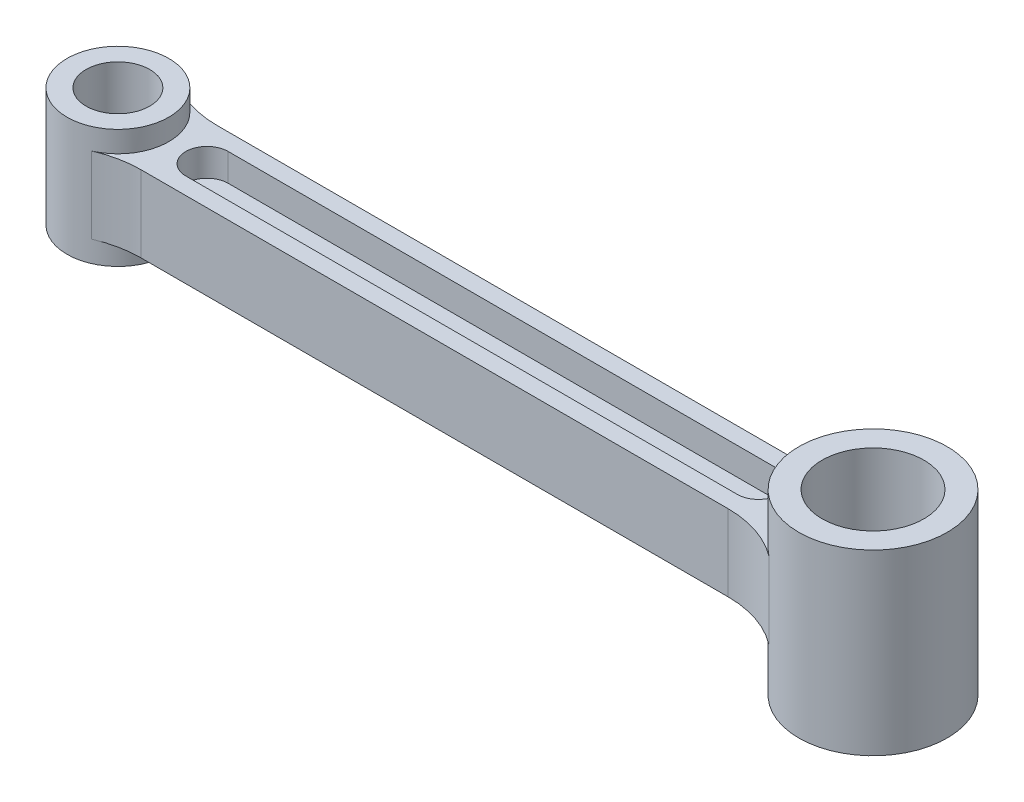
ISO-10303-21;
HEADER;
FILE_DESCRIPTION(('STEP AP214'),'2;1');
FILE_NAME('part.step','',(''),(''),'','','');
FILE_SCHEMA(('AUTOMOTIVE_DESIGN { 1 0 10303 214 1 1 1 1 }'));
ENDSEC;
DATA;
#1=APPLICATION_CONTEXT('core data for automotive mechanical design processes');
#2=APPLICATION_PROTOCOL_DEFINITION('international standard','automotive_design',2000,#1);
#3=PRODUCT_CONTEXT('',#1,'mechanical');
#4=PRODUCT('Part','Part','',(#3));
#5=PRODUCT_RELATED_PRODUCT_CATEGORY('part','',(#4));
#6=PRODUCT_DEFINITION_FORMATION('','',#4);
#7=PRODUCT_DEFINITION_CONTEXT('part definition',#1,'design');
#8=PRODUCT_DEFINITION('design','',#6,#7);
#9=PRODUCT_DEFINITION_SHAPE('','',#8);
#10=(LENGTH_UNIT() NAMED_UNIT(*) SI_UNIT(.MILLI.,.METRE.));
#11=(NAMED_UNIT(*) PLANE_ANGLE_UNIT() SI_UNIT($,.RADIAN.));
#12=(NAMED_UNIT(*) SI_UNIT($,.STERADIAN.) SOLID_ANGLE_UNIT());
#13=UNCERTAINTY_MEASURE_WITH_UNIT(LENGTH_MEASURE(1.E-05),#10,'distance_accuracy_value','');
#14=(GEOMETRIC_REPRESENTATION_CONTEXT(3) GLOBAL_UNCERTAINTY_ASSIGNED_CONTEXT((#13)) GLOBAL_UNIT_ASSIGNED_CONTEXT((#10,
#11,#12)) REPRESENTATION_CONTEXT('',''));
#15=CARTESIAN_POINT('',(0.,0.,0.));
#16=DIRECTION('',(0.,0.,1.));
#17=DIRECTION('',(1.,0.,0.));
#18=AXIS2_PLACEMENT_3D('',#15,#16,#17);
#19=CARTESIAN_POINT('',(0.,-9.,0.));
#20=DIRECTION('',(0.,1.,0.));
#21=DIRECTION('',(0.,0.,1.));
#22=AXIS2_PLACEMENT_3D('',#19,#20,#21);
#23=PLANE('',#22);
#24=CARTESIAN_POINT('',(0.,-9.,0.));
#25=DIRECTION('',(0.,-1.,0.));
#26=DIRECTION('',(0.,0.,1.));
#27=AXIS2_PLACEMENT_3D('',#24,#25,#26);
#28=CIRCLE('',#27,12.);
#29=CARTESIAN_POINT('',(4.79583152331272,-9.,-11.));
#30=VERTEX_POINT('',#29);
#31=CARTESIAN_POINT('',(4.79583152331272,-9.,11.));
#32=VERTEX_POINT('',#31);
#33=EDGE_CURVE('E265',#30,#32,#28,.T.);
#34=ORIENTED_EDGE('',*,*,#33,.F.);
#35=CARTESIAN_POINT('',(14.3874945699382,-9.,-33.));
#36=DIRECTION('',(0.,1.,0.));
#37=DIRECTION('',(0.,0.,1.));
#38=AXIS2_PLACEMENT_3D('',#35,#36,#37);
#39=CIRCLE('',#38,24.);
#40=CARTESIAN_POINT('',(14.3874945699382,-9.,-9.));
#41=VERTEX_POINT('',#40);
#42=EDGE_CURVE('E339',#30,#41,#39,.T.);
#43=ORIENTED_EDGE('',*,*,#42,.T.);
#44=DIRECTION('',(-1.,0.,0.));
#45=VECTOR('',#44,1.);
#46=CARTESIAN_POINT('',(7.93725393319378,-9.,-9.));
#47=LINE('',#46,#45);
#48=CARTESIAN_POINT('',(152.835540935677,-9.,-9.));
#49=VERTEX_POINT('',#48);
#50=EDGE_CURVE('E273',#49,#41,#47,.T.);
#51=ORIENTED_EDGE('',*,*,#50,.F.);
#52=CARTESIAN_POINT('',(152.835540935677,-9.,-33.));
#53=DIRECTION('',(0.,1.,0.));
#54=DIRECTION('',(0.,0.,1.));
#55=AXIS2_PLACEMENT_3D('',#52,#53,#54);
#56=CIRCLE('',#55,24.);
#57=CARTESIAN_POINT('',(167.388481117454,-9.,-13.9156626506024));
#58=VERTEX_POINT('',#57);
#59=EDGE_CURVE('E346',#49,#58,#56,.T.);
#60=ORIENTED_EDGE('',*,*,#59,.T.);
#61=CARTESIAN_POINT('',(178.,-9.,0.));
#62=DIRECTION('',(0.,-1.,0.));
#63=DIRECTION('',(0.,0.,1.));
#64=AXIS2_PLACEMENT_3D('',#61,#62,#63);
#65=CIRCLE('',#64,17.5);
#66=CARTESIAN_POINT('',(167.388481117454,-9.,13.9156626506024));
#67=VERTEX_POINT('',#66);
#68=EDGE_CURVE('E289',#67,#58,#65,.T.);
#69=ORIENTED_EDGE('',*,*,#68,.F.);
#70=CARTESIAN_POINT('',(152.835540935677,-9.,33.));
#71=DIRECTION('',(0.,1.,0.));
#72=DIRECTION('',(0.,0.,1.));
#73=AXIS2_PLACEMENT_3D('',#70,#71,#72);
#74=CIRCLE('',#73,24.);
#75=CARTESIAN_POINT('',(152.835540935677,-9.,9.));
#76=VERTEX_POINT('',#75);
#77=EDGE_CURVE('E353',#67,#76,#74,.T.);
#78=ORIENTED_EDGE('',*,*,#77,.T.);
#79=DIRECTION('',(1.,0.,0.));
#80=VECTOR('',#79,1.);
#81=CARTESIAN_POINT('',(7.93725393319378,-9.,9.));
#82=LINE('',#81,#80);
#83=CARTESIAN_POINT('',(14.3874945699382,-9.,9.));
#84=VERTEX_POINT('',#83);
#85=EDGE_CURVE('E286',#84,#76,#82,.T.);
#86=ORIENTED_EDGE('',*,*,#85,.F.);
#87=CARTESIAN_POINT('',(14.3874945699382,-9.,33.));
#88=DIRECTION('',(0.,1.,0.));
#89=DIRECTION('',(0.,0.,1.));
#90=AXIS2_PLACEMENT_3D('',#87,#88,#89);
#91=CIRCLE('',#90,24.);
#92=EDGE_CURVE('E49',#84,#32,#91,.T.);
#93=ORIENTED_EDGE('',*,*,#92,.T.);
#94=EDGE_LOOP('',(#34,#43,#51,#60,#69,#78,#86,#93));
#95=FACE_BOUND('',#94,.T.);
#96=CARTESIAN_POINT('',(21.,-9.,0.));
#97=DIRECTION('',(0.,1.,0.));
#98=DIRECTION('',(0.,0.,1.));
#99=AXIS2_PLACEMENT_3D('',#96,#97,#98);
#100=CIRCLE('',#99,5.);
#101=CARTESIAN_POINT('',(21.,-9.,-5.));
#102=VERTEX_POINT('',#101);
#103=CARTESIAN_POINT('',(21.,-9.,5.));
#104=VERTEX_POINT('',#103);
#105=EDGE_CURVE('E174',#102,#104,#100,.T.);
#106=ORIENTED_EDGE('',*,*,#105,.T.);
#107=DIRECTION('',(1.,0.,0.));
#108=VECTOR('',#107,1.);
#109=CARTESIAN_POINT('',(21.,-9.,5.));
#110=LINE('',#109,#108);
#111=CARTESIAN_POINT('',(151.,-9.,5.));
#112=VERTEX_POINT('',#111);
#113=EDGE_CURVE('E180',#104,#112,#110,.T.);
#114=ORIENTED_EDGE('',*,*,#113,.T.);
#115=CARTESIAN_POINT('',(151.,-9.,0.));
#116=DIRECTION('',(0.,1.,0.));
#117=DIRECTION('',(0.,0.,-1.));
#118=AXIS2_PLACEMENT_3D('',#115,#116,#117);
#119=CIRCLE('',#118,5.);
#120=CARTESIAN_POINT('',(151.,-9.,-5.));
#121=VERTEX_POINT('',#120);
#122=EDGE_CURVE('E185',#112,#121,#119,.T.);
#123=ORIENTED_EDGE('',*,*,#122,.T.);
#124=DIRECTION('',(-1.,0.,0.));
#125=VECTOR('',#124,1.);
#126=CARTESIAN_POINT('',(21.,-9.,-5.));
#127=LINE('',#126,#125);
#128=EDGE_CURVE('E194',#121,#102,#127,.T.);
#129=ORIENTED_EDGE('',*,*,#128,.T.);
#130=EDGE_LOOP('',(#106,#114,#123,#129));
#131=FACE_BOUND('',#130,.T.);
#132=ADVANCED_FACE('F40',(#95,#131),#23,.F.);
#133=CARTESIAN_POINT('',(0.,14.,0.));
#134=DIRECTION('',(0.,1.,0.));
#135=DIRECTION('',(0.,0.,1.));
#136=AXIS2_PLACEMENT_3D('',#133,#134,#135);
#137=PLANE('',#136);
#138=CARTESIAN_POINT('',(0.,14.,0.));
#139=DIRECTION('',(0.,1.,0.));
#140=DIRECTION('',(0.,0.,1.));
#141=AXIS2_PLACEMENT_3D('',#138,#139,#140);
#142=CIRCLE('',#141,12.);
#143=CARTESIAN_POINT('',(0.,14.,12.));
#144=VERTEX_POINT('',#143);
#145=EDGE_CURVE('E303',#144,#144,#142,.T.);
#146=ORIENTED_EDGE('',*,*,#145,.T.);
#147=EDGE_LOOP('',(#146));
#148=FACE_BOUND('',#147,.T.);
#149=CARTESIAN_POINT('',(0.,14.,0.));
#150=DIRECTION('',(0.,1.,0.));
#151=DIRECTION('',(0.,0.,1.));
#152=AXIS2_PLACEMENT_3D('',#149,#150,#151);
#153=CIRCLE('',#152,7.5);
#154=CARTESIAN_POINT('',(0.,14.,7.5));
#155=VERTEX_POINT('',#154);
#156=EDGE_CURVE('E295',#155,#155,#153,.T.);
#157=ORIENTED_EDGE('',*,*,#156,.F.);
#158=EDGE_LOOP('',(#157));
#159=FACE_BOUND('',#158,.T.);
#160=ADVANCED_FACE('F407',(#148,#159),#137,.T.);
#161=CARTESIAN_POINT('',(0.,-14.,0.));
#162=DIRECTION('',(0.,1.,0.));
#163=DIRECTION('',(0.,0.,1.));
#164=AXIS2_PLACEMENT_3D('',#161,#162,#163);
#165=PLANE('',#164);
#166=CARTESIAN_POINT('',(0.,-14.,0.));
#167=DIRECTION('',(0.,1.,0.));
#168=DIRECTION('',(0.,0.,1.));
#169=AXIS2_PLACEMENT_3D('',#166,#167,#168);
#170=CIRCLE('',#169,12.);
#171=CARTESIAN_POINT('',(0.,-14.,12.));
#172=VERTEX_POINT('',#171);
#173=EDGE_CURVE('E299',#172,#172,#170,.T.);
#174=ORIENTED_EDGE('',*,*,#173,.F.);
#175=EDGE_LOOP('',(#174));
#176=FACE_BOUND('',#175,.T.);
#177=CARTESIAN_POINT('',(0.,-14.,0.));
#178=DIRECTION('',(0.,1.,0.));
#179=DIRECTION('',(0.,0.,1.));
#180=AXIS2_PLACEMENT_3D('',#177,#178,#179);
#181=CIRCLE('',#180,7.5);
#182=CARTESIAN_POINT('',(0.,-14.,7.5));
#183=VERTEX_POINT('',#182);
#184=EDGE_CURVE('E283',#183,#183,#181,.T.);
#185=ORIENTED_EDGE('',*,*,#184,.T.);
#186=EDGE_LOOP('',(#185));
#187=FACE_BOUND('',#186,.T.);
#188=ADVANCED_FACE('F412',(#176,#187),#165,.F.);
#189=CARTESIAN_POINT('',(0.,14.,0.));
#190=DIRECTION('',(0.,-1.,0.));
#191=DIRECTION('',(0.,0.,-1.));
#192=AXIS2_PLACEMENT_3D('',#189,#190,#191);
#193=CYLINDRICAL_SURFACE('',#192,12.);
#194=DIRECTION('',(0.,-1.,0.));
#195=VECTOR('',#194,1.);
#196=CARTESIAN_POINT('',(4.79583152331272,14.,-11.));
#197=LINE('',#196,#195);
#198=CARTESIAN_POINT('',(4.79583152331272,9.,-11.));
#199=VERTEX_POINT('',#198);
#200=EDGE_CURVE('E314',#199,#30,#197,.T.);
#201=ORIENTED_EDGE('',*,*,#200,.T.);
#202=ORIENTED_EDGE('',*,*,#33,.T.);
#203=DIRECTION('',(0.,-1.,0.));
#204=VECTOR('',#203,1.);
#205=CARTESIAN_POINT('',(4.79583152331272,14.,11.));
#206=LINE('',#205,#204);
#207=CARTESIAN_POINT('',(4.79583152331272,9.,11.));
#208=VERTEX_POINT('',#207);
#209=EDGE_CURVE('E307',#32,#208,#206,.F.);
#210=ORIENTED_EDGE('',*,*,#209,.T.);
#211=CARTESIAN_POINT('',(0.,9.,0.));
#212=DIRECTION('',(0.,-1.,0.));
#213=DIRECTION('',(0.,0.,1.));
#214=AXIS2_PLACEMENT_3D('',#211,#212,#213);
#215=CIRCLE('',#214,12.);
#216=EDGE_CURVE('E269',#199,#208,#215,.T.);
#217=ORIENTED_EDGE('',*,*,#216,.F.);
#218=EDGE_LOOP('',(#201,#202,#210,#217));
#219=FACE_BOUND('',#218,.T.);
#220=ORIENTED_EDGE('',*,*,#145,.F.);
#221=EDGE_LOOP('',(#220));
#222=FACE_BOUND('',#221,.T.);
#223=ORIENTED_EDGE('',*,*,#173,.T.);
#224=EDGE_LOOP('',(#223));
#225=FACE_BOUND('',#224,.T.);
#226=ADVANCED_FACE('F370',(#219,#222,#225),#193,.T.);
#227=CARTESIAN_POINT('',(0.,14.,0.));
#228=DIRECTION('',(0.,-1.,0.));
#229=DIRECTION('',(0.,0.,-1.));
#230=AXIS2_PLACEMENT_3D('',#227,#228,#229);
#231=CYLINDRICAL_SURFACE('',#230,7.5);
#232=ORIENTED_EDGE('',*,*,#156,.T.);
#233=EDGE_LOOP('',(#232));
#234=FACE_BOUND('',#233,.T.);
#235=ORIENTED_EDGE('',*,*,#184,.F.);
#236=EDGE_LOOP('',(#235));
#237=FACE_BOUND('',#236,.T.);
#238=ADVANCED_FACE('F397',(#234,#237),#231,.F.);
#239=CARTESIAN_POINT('',(7.93725393319378,9.,9.));
#240=DIRECTION('',(0.,0.,-1.));
#241=DIRECTION('',(-1.,0.,0.));
#242=AXIS2_PLACEMENT_3D('',#239,#240,#241);
#243=PLANE('',#242);
#244=ORIENTED_EDGE('',*,*,#85,.T.);
#245=DIRECTION('',(0.,1.,0.));
#246=VECTOR('',#245,1.);
#247=CARTESIAN_POINT('',(152.835540935677,9.,9.));
#248=LINE('',#247,#246);
#249=CARTESIAN_POINT('',(152.835540935677,9.,9.));
#250=VERTEX_POINT('',#249);
#251=EDGE_CURVE('E56',#76,#250,#248,.T.);
#252=ORIENTED_EDGE('',*,*,#251,.T.);
#253=DIRECTION('',(1.,0.,0.));
#254=VECTOR('',#253,1.);
#255=CARTESIAN_POINT('',(7.93725393319378,9.,9.));
#256=LINE('',#255,#254);
#257=CARTESIAN_POINT('',(14.3874945699382,9.,9.));
#258=VERTEX_POINT('',#257);
#259=EDGE_CURVE('E272',#258,#250,#256,.T.);
#260=ORIENTED_EDGE('',*,*,#259,.F.);
#261=DIRECTION('',(0.,1.,0.));
#262=VECTOR('',#261,1.);
#263=CARTESIAN_POINT('',(14.3874945699382,-9.,9.));
#264=LINE('',#263,#262);
#265=EDGE_CURVE('E333',#258,#84,#264,.F.);
#266=ORIENTED_EDGE('',*,*,#265,.T.);
#267=EDGE_LOOP('',(#244,#252,#260,#266));
#268=FACE_BOUND('',#267,.T.);
#269=ADVANCED_FACE('F395',(#268),#243,.F.);
#270=CARTESIAN_POINT('',(7.93725393319378,9.,-9.));
#271=DIRECTION('',(0.,0.,1.));
#272=DIRECTION('',(1.,0.,0.));
#273=AXIS2_PLACEMENT_3D('',#270,#271,#272);
#274=PLANE('',#273);
#275=ORIENTED_EDGE('',*,*,#50,.T.);
#276=DIRECTION('',(0.,1.,0.));
#277=VECTOR('',#276,1.);
#278=CARTESIAN_POINT('',(14.3874945699382,9.,-9.));
#279=LINE('',#278,#277);
#280=CARTESIAN_POINT('',(14.3874945699382,9.,-9.));
#281=VERTEX_POINT('',#280);
#282=EDGE_CURVE('E322',#41,#281,#279,.T.);
#283=ORIENTED_EDGE('',*,*,#282,.T.);
#284=DIRECTION('',(-1.,0.,0.));
#285=VECTOR('',#284,1.);
#286=CARTESIAN_POINT('',(7.93725393319378,9.,-9.));
#287=LINE('',#286,#285);
#288=CARTESIAN_POINT('',(152.835540935677,9.,-9.));
#289=VERTEX_POINT('',#288);
#290=EDGE_CURVE('E279',#289,#281,#287,.T.);
#291=ORIENTED_EDGE('',*,*,#290,.F.);
#292=DIRECTION('',(0.,1.,0.));
#293=VECTOR('',#292,1.);
#294=CARTESIAN_POINT('',(152.835540935677,-8.99999999999999,-9.));
#295=LINE('',#294,#293);
#296=EDGE_CURVE('E318',#289,#49,#295,.F.);
#297=ORIENTED_EDGE('',*,*,#296,.T.);
#298=EDGE_LOOP('',(#275,#283,#291,#297));
#299=FACE_BOUND('',#298,.T.);
#300=ADVANCED_FACE('F379',(#299),#274,.F.);
#301=CARTESIAN_POINT('',(0.,9.,0.));
#302=DIRECTION('',(0.,1.,0.));
#303=DIRECTION('',(0.,0.,1.));
#304=AXIS2_PLACEMENT_3D('',#301,#302,#303);
#305=PLANE('',#304);
#306=CARTESIAN_POINT('',(21.,9.,0.));
#307=DIRECTION('',(0.,1.,0.));
#308=DIRECTION('',(0.,0.,1.));
#309=AXIS2_PLACEMENT_3D('',#306,#307,#308);
#310=CIRCLE('',#309,5.);
#311=CARTESIAN_POINT('',(21.,9.,-5.));
#312=VERTEX_POINT('',#311);
#313=CARTESIAN_POINT('',(21.,9.,5.));
#314=VERTEX_POINT('',#313);
#315=EDGE_CURVE('E203',#312,#314,#310,.T.);
#316=ORIENTED_EDGE('',*,*,#315,.F.);
#317=DIRECTION('',(-1.,0.,0.));
#318=VECTOR('',#317,1.);
#319=CARTESIAN_POINT('',(21.,9.,-5.));
#320=LINE('',#319,#318);
#321=CARTESIAN_POINT('',(151.,9.,-5.));
#322=VERTEX_POINT('',#321);
#323=EDGE_CURVE('E214',#322,#312,#320,.T.);
#324=ORIENTED_EDGE('',*,*,#323,.F.);
#325=CARTESIAN_POINT('',(151.,9.,0.));
#326=DIRECTION('',(0.,1.,0.));
#327=DIRECTION('',(0.,0.,-1.));
#328=AXIS2_PLACEMENT_3D('',#325,#326,#327);
#329=CIRCLE('',#328,5.);
#330=CARTESIAN_POINT('',(151.,9.,5.));
#331=VERTEX_POINT('',#330);
#332=EDGE_CURVE('E233',#331,#322,#329,.T.);
#333=ORIENTED_EDGE('',*,*,#332,.F.);
#334=DIRECTION('',(1.,0.,0.));
#335=VECTOR('',#334,1.);
#336=CARTESIAN_POINT('',(21.,9.,5.));
#337=LINE('',#336,#335);
#338=EDGE_CURVE('E229',#314,#331,#337,.T.);
#339=ORIENTED_EDGE('',*,*,#338,.F.);
#340=EDGE_LOOP('',(#316,#324,#333,#339));
#341=FACE_BOUND('',#340,.T.);
#342=ORIENTED_EDGE('',*,*,#216,.T.);
#343=CARTESIAN_POINT('',(14.3874945699382,9.,33.));
#344=DIRECTION('',(0.,1.,0.));
#345=DIRECTION('',(0.,0.,1.));
#346=AXIS2_PLACEMENT_3D('',#343,#344,#345);
#347=CIRCLE('',#346,24.);
#348=EDGE_CURVE('E11',#208,#258,#347,.F.);
#349=ORIENTED_EDGE('',*,*,#348,.T.);
#350=ORIENTED_EDGE('',*,*,#259,.T.);
#351=CARTESIAN_POINT('',(152.835540935677,9.,33.));
#352=DIRECTION('',(0.,1.,0.));
#353=DIRECTION('',(0.,0.,1.));
#354=AXIS2_PLACEMENT_3D('',#351,#352,#353);
#355=CIRCLE('',#354,24.);
#356=CARTESIAN_POINT('',(167.388481117454,9.,13.9156626506024));
#357=VERTEX_POINT('',#356);
#358=EDGE_CURVE('E356',#250,#357,#355,.F.);
#359=ORIENTED_EDGE('',*,*,#358,.T.);
#360=CARTESIAN_POINT('',(178.,9.,0.));
#361=DIRECTION('',(0.,-1.,0.));
#362=DIRECTION('',(0.,0.,1.));
#363=AXIS2_PLACEMENT_3D('',#360,#361,#362);
#364=CIRCLE('',#363,17.5);
#365=CARTESIAN_POINT('',(167.388481117454,9.,-13.9156626506024));
#366=VERTEX_POINT('',#365);
#367=EDGE_CURVE('E276',#357,#366,#364,.T.);
#368=ORIENTED_EDGE('',*,*,#367,.T.);
#369=CARTESIAN_POINT('',(152.835540935677,9.,-33.));
#370=DIRECTION('',(0.,1.,0.));
#371=DIRECTION('',(0.,0.,1.));
#372=AXIS2_PLACEMENT_3D('',#369,#370,#371);
#373=CIRCLE('',#372,24.);
#374=EDGE_CURVE('E350',#366,#289,#373,.F.);
#375=ORIENTED_EDGE('',*,*,#374,.T.);
#376=ORIENTED_EDGE('',*,*,#290,.T.);
#377=CARTESIAN_POINT('',(14.3874945699382,9.,-33.));
#378=DIRECTION('',(0.,1.,0.));
#379=DIRECTION('',(0.,0.,1.));
#380=AXIS2_PLACEMENT_3D('',#377,#378,#379);
#381=CIRCLE('',#380,24.);
#382=EDGE_CURVE('E342',#281,#199,#381,.F.);
#383=ORIENTED_EDGE('',*,*,#382,.T.);
#384=EDGE_LOOP('',(#342,#349,#350,#359,#368,#375,#376,#383));
#385=FACE_BOUND('',#384,.T.);
#386=ADVANCED_FACE('F394',(#341,#385),#305,.T.);
#387=CARTESIAN_POINT('',(178.,21.,0.));
#388=DIRECTION('',(0.,1.,0.));
#389=DIRECTION('',(0.,0.,1.));
#390=AXIS2_PLACEMENT_3D('',#387,#388,#389);
#391=PLANE('',#390);
#392=CARTESIAN_POINT('',(178.,21.,0.));
#393=DIRECTION('',(0.,1.,0.));
#394=DIRECTION('',(0.,0.,1.));
#395=AXIS2_PLACEMENT_3D('',#392,#393,#394);
#396=CIRCLE('',#395,17.5);
#397=CARTESIAN_POINT('',(178.,21.,17.5));
#398=VERTEX_POINT('',#397);
#399=EDGE_CURVE('E261',#398,#398,#396,.T.);
#400=ORIENTED_EDGE('',*,*,#399,.T.);
#401=EDGE_LOOP('',(#400));
#402=FACE_BOUND('',#401,.T.);
#403=CARTESIAN_POINT('',(178.,21.,0.));
#404=DIRECTION('',(0.,1.,0.));
#405=DIRECTION('',(0.,0.,1.));
#406=AXIS2_PLACEMENT_3D('',#403,#404,#405);
#407=CIRCLE('',#406,12.);
#408=CARTESIAN_POINT('',(178.,21.,12.));
#409=VERTEX_POINT('',#408);
#410=EDGE_CURVE('E253',#409,#409,#407,.T.);
#411=ORIENTED_EDGE('',*,*,#410,.F.);
#412=EDGE_LOOP('',(#411));
#413=FACE_BOUND('',#412,.T.);
#414=ADVANCED_FACE('F418',(#402,#413),#391,.T.);
#415=CARTESIAN_POINT('',(178.,-21.,0.));
#416=DIRECTION('',(0.,1.,0.));
#417=DIRECTION('',(0.,0.,1.));
#418=AXIS2_PLACEMENT_3D('',#415,#416,#417);
#419=PLANE('',#418);
#420=CARTESIAN_POINT('',(178.,-21.,0.));
#421=DIRECTION('',(0.,1.,0.));
#422=DIRECTION('',(0.,0.,1.));
#423=AXIS2_PLACEMENT_3D('',#420,#421,#422);
#424=CIRCLE('',#423,17.5);
#425=CARTESIAN_POINT('',(178.,-21.,17.5));
#426=VERTEX_POINT('',#425);
#427=EDGE_CURVE('E257',#426,#426,#424,.T.);
#428=ORIENTED_EDGE('',*,*,#427,.F.);
#429=EDGE_LOOP('',(#428));
#430=FACE_BOUND('',#429,.T.);
#431=CARTESIAN_POINT('',(178.,-21.,0.));
#432=DIRECTION('',(0.,1.,0.));
#433=DIRECTION('',(0.,0.,1.));
#434=AXIS2_PLACEMENT_3D('',#431,#432,#433);
#435=CIRCLE('',#434,12.);
#436=CARTESIAN_POINT('',(178.,-21.,12.));
#437=VERTEX_POINT('',#436);
#438=EDGE_CURVE('E243',#437,#437,#435,.T.);
#439=ORIENTED_EDGE('',*,*,#438,.T.);
#440=EDGE_LOOP('',(#439));
#441=FACE_BOUND('',#440,.T.);
#442=ADVANCED_FACE('F423',(#430,#441),#419,.F.);
#443=CARTESIAN_POINT('',(178.,21.,0.));
#444=DIRECTION('',(0.,-1.,0.));
#445=DIRECTION('',(0.,0.,-1.));
#446=AXIS2_PLACEMENT_3D('',#443,#444,#445);
#447=CYLINDRICAL_SURFACE('',#446,17.5);
#448=ORIENTED_EDGE('',*,*,#68,.T.);
#449=DIRECTION('',(0.,-1.,0.));
#450=VECTOR('',#449,1.);
#451=CARTESIAN_POINT('',(167.388481117454,21.,-13.9156626506024));
#452=LINE('',#451,#450);
#453=EDGE_CURVE('E329',#58,#366,#452,.F.);
#454=ORIENTED_EDGE('',*,*,#453,.T.);
#455=ORIENTED_EDGE('',*,*,#367,.F.);
#456=DIRECTION('',(0.,-1.,0.));
#457=VECTOR('',#456,1.);
#458=CARTESIAN_POINT('',(167.388481117454,21.,13.9156626506024));
#459=LINE('',#458,#457);
#460=EDGE_CURVE('E325',#357,#67,#459,.T.);
#461=ORIENTED_EDGE('',*,*,#460,.T.);
#462=EDGE_LOOP('',(#448,#454,#455,#461));
#463=FACE_BOUND('',#462,.T.);
#464=ORIENTED_EDGE('',*,*,#399,.F.);
#465=EDGE_LOOP('',(#464));
#466=FACE_BOUND('',#465,.T.);
#467=ORIENTED_EDGE('',*,*,#427,.T.);
#468=EDGE_LOOP('',(#467));
#469=FACE_BOUND('',#468,.T.);
#470=ADVANCED_FACE('F392',(#463,#466,#469),#447,.T.);
#471=CARTESIAN_POINT('',(178.,21.,0.));
#472=DIRECTION('',(0.,-1.,0.));
#473=DIRECTION('',(0.,0.,-1.));
#474=AXIS2_PLACEMENT_3D('',#471,#472,#473);
#475=CYLINDRICAL_SURFACE('',#474,12.);
#476=ORIENTED_EDGE('',*,*,#410,.T.);
#477=EDGE_LOOP('',(#476));
#478=FACE_BOUND('',#477,.T.);
#479=ORIENTED_EDGE('',*,*,#438,.F.);
#480=EDGE_LOOP('',(#479));
#481=FACE_BOUND('',#480,.T.);
#482=ADVANCED_FACE('F422',(#478,#481),#475,.F.);
#483=CARTESIAN_POINT('',(21.,2.5,0.));
#484=DIRECTION('',(0.,1.,0.));
#485=DIRECTION('',(0.,0.,1.));
#486=AXIS2_PLACEMENT_3D('',#483,#484,#485);
#487=CYLINDRICAL_SURFACE('',#486,5.);
#488=ORIENTED_EDGE('',*,*,#315,.T.);
#489=DIRECTION('',(0.,1.,0.));
#490=VECTOR('',#489,1.);
#491=CARTESIAN_POINT('',(21.,2.5,5.));
#492=LINE('',#491,#490);
#493=CARTESIAN_POINT('',(21.,2.5,5.));
#494=VERTEX_POINT('',#493);
#495=EDGE_CURVE('E226',#494,#314,#492,.T.);
#496=ORIENTED_EDGE('',*,*,#495,.F.);
#497=CARTESIAN_POINT('',(21.,2.5,0.));
#498=DIRECTION('',(0.,1.,0.));
#499=DIRECTION('',(0.,0.,1.));
#500=AXIS2_PLACEMENT_3D('',#497,#498,#499);
#501=CIRCLE('',#500,5.);
#502=CARTESIAN_POINT('',(21.,2.5,-5.));
#503=VERTEX_POINT('',#502);
#504=EDGE_CURVE('E209',#503,#494,#501,.T.);
#505=ORIENTED_EDGE('',*,*,#504,.F.);
#506=DIRECTION('',(0.,1.,0.));
#507=VECTOR('',#506,1.);
#508=CARTESIAN_POINT('',(21.,2.5,-5.));
#509=LINE('',#508,#507);
#510=EDGE_CURVE('E240',#503,#312,#509,.T.);
#511=ORIENTED_EDGE('',*,*,#510,.T.);
#512=EDGE_LOOP('',(#488,#496,#505,#511));
#513=FACE_BOUND('',#512,.T.);
#514=ADVANCED_FACE('F432',(#513),#487,.F.);
#515=CARTESIAN_POINT('',(21.,2.5,-5.));
#516=DIRECTION('',(0.,0.,-1.));
#517=DIRECTION('',(-1.,0.,0.));
#518=AXIS2_PLACEMENT_3D('',#515,#516,#517);
#519=PLANE('',#518);
#520=ORIENTED_EDGE('',*,*,#323,.T.);
#521=ORIENTED_EDGE('',*,*,#510,.F.);
#522=DIRECTION('',(-1.,0.,0.));
#523=VECTOR('',#522,1.);
#524=CARTESIAN_POINT('',(21.,2.5,-5.));
#525=LINE('',#524,#523);
#526=CARTESIAN_POINT('',(151.,2.5,-5.));
#527=VERTEX_POINT('',#526);
#528=EDGE_CURVE('E222',#527,#503,#525,.T.);
#529=ORIENTED_EDGE('',*,*,#528,.F.);
#530=DIRECTION('',(0.,1.,0.));
#531=VECTOR('',#530,1.);
#532=CARTESIAN_POINT('',(151.,2.5,-5.));
#533=LINE('',#532,#531);
#534=EDGE_CURVE('E244',#527,#322,#533,.T.);
#535=ORIENTED_EDGE('',*,*,#534,.T.);
#536=EDGE_LOOP('',(#520,#521,#529,#535));
#537=FACE_BOUND('',#536,.T.);
#538=ADVANCED_FACE('F436',(#537),#519,.F.);
#539=CARTESIAN_POINT('',(151.,2.5,0.));
#540=DIRECTION('',(0.,1.,0.));
#541=DIRECTION('',(0.,0.,1.));
#542=AXIS2_PLACEMENT_3D('',#539,#540,#541);
#543=CYLINDRICAL_SURFACE('',#542,5.);
#544=ORIENTED_EDGE('',*,*,#332,.T.);
#545=ORIENTED_EDGE('',*,*,#534,.F.);
#546=CARTESIAN_POINT('',(151.,2.5,0.));
#547=DIRECTION('',(0.,1.,0.));
#548=DIRECTION('',(0.,0.,-1.));
#549=AXIS2_PLACEMENT_3D('',#546,#547,#548);
#550=CIRCLE('',#549,5.);
#551=CARTESIAN_POINT('',(151.,2.5,5.));
#552=VERTEX_POINT('',#551);
#553=EDGE_CURVE('E218',#552,#527,#550,.T.);
#554=ORIENTED_EDGE('',*,*,#553,.F.);
#555=DIRECTION('',(0.,1.,0.));
#556=VECTOR('',#555,1.);
#557=CARTESIAN_POINT('',(151.,2.5,5.));
#558=LINE('',#557,#556);
#559=EDGE_CURVE('E247',#552,#331,#558,.T.);
#560=ORIENTED_EDGE('',*,*,#559,.T.);
#561=EDGE_LOOP('',(#544,#545,#554,#560));
#562=FACE_BOUND('',#561,.T.);
#563=ADVANCED_FACE('F442',(#562),#543,.F.);
#564=CARTESIAN_POINT('',(21.,2.5,5.));
#565=DIRECTION('',(0.,0.,1.));
#566=DIRECTION('',(1.,0.,0.));
#567=AXIS2_PLACEMENT_3D('',#564,#565,#566);
#568=PLANE('',#567);
#569=ORIENTED_EDGE('',*,*,#338,.T.);
#570=ORIENTED_EDGE('',*,*,#559,.F.);
#571=DIRECTION('',(1.,0.,0.));
#572=VECTOR('',#571,1.);
#573=CARTESIAN_POINT('',(21.,2.5,5.));
#574=LINE('',#573,#572);
#575=EDGE_CURVE('E213',#494,#552,#574,.T.);
#576=ORIENTED_EDGE('',*,*,#575,.F.);
#577=ORIENTED_EDGE('',*,*,#495,.T.);
#578=EDGE_LOOP('',(#569,#570,#576,#577));
#579=FACE_BOUND('',#578,.T.);
#580=ADVANCED_FACE('F438',(#579),#568,.F.);
#581=CARTESIAN_POINT('',(21.,2.5,0.));
#582=DIRECTION('',(0.,1.,0.));
#583=DIRECTION('',(0.,0.,1.));
#584=AXIS2_PLACEMENT_3D('',#581,#582,#583);
#585=PLANE('',#584);
#586=ORIENTED_EDGE('',*,*,#504,.T.);
#587=ORIENTED_EDGE('',*,*,#575,.T.);
#588=ORIENTED_EDGE('',*,*,#553,.T.);
#589=ORIENTED_EDGE('',*,*,#528,.T.);
#590=EDGE_LOOP('',(#586,#587,#588,#589));
#591=FACE_BOUND('',#590,.T.);
#592=ADVANCED_FACE('F441',(#591),#585,.T.);
#593=CARTESIAN_POINT('',(21.,-2.5,0.));
#594=DIRECTION('',(0.,-1.,0.));
#595=DIRECTION('',(0.,0.,-1.));
#596=AXIS2_PLACEMENT_3D('',#593,#594,#595);
#597=CYLINDRICAL_SURFACE('',#596,5.);
#598=ORIENTED_EDGE('',*,*,#105,.F.);
#599=DIRECTION('',(0.,-1.,0.));
#600=VECTOR('',#599,1.);
#601=CARTESIAN_POINT('',(21.,-2.5,-5.));
#602=LINE('',#601,#600);
#603=CARTESIAN_POINT('',(21.,-2.5,-5.));
#604=VERTEX_POINT('',#603);
#605=EDGE_CURVE('E158',#604,#102,#602,.T.);
#606=ORIENTED_EDGE('',*,*,#605,.F.);
#607=CARTESIAN_POINT('',(21.,-2.5,0.));
#608=DIRECTION('',(0.,1.,0.));
#609=DIRECTION('',(0.,0.,1.));
#610=AXIS2_PLACEMENT_3D('',#607,#608,#609);
#611=CIRCLE('',#610,5.);
#612=CARTESIAN_POINT('',(21.,-2.5,5.));
#613=VERTEX_POINT('',#612);
#614=EDGE_CURVE('E166',#604,#613,#611,.T.);
#615=ORIENTED_EDGE('',*,*,#614,.T.);
#616=DIRECTION('',(0.,-1.,0.));
#617=VECTOR('',#616,1.);
#618=CARTESIAN_POINT('',(21.,-2.5,5.));
#619=LINE('',#618,#617);
#620=EDGE_CURVE('E200',#613,#104,#619,.T.);
#621=ORIENTED_EDGE('',*,*,#620,.T.);
#622=EDGE_LOOP('',(#598,#606,#615,#621));
#623=FACE_BOUND('',#622,.T.);
#624=ADVANCED_FACE('F170',(#623),#597,.F.);
#625=CARTESIAN_POINT('',(21.,-2.5,5.));
#626=DIRECTION('',(0.,0.,-1.));
#627=DIRECTION('',(-1.,0.,0.));
#628=AXIS2_PLACEMENT_3D('',#625,#626,#627);
#629=PLANE('',#628);
#630=ORIENTED_EDGE('',*,*,#113,.F.);
#631=ORIENTED_EDGE('',*,*,#620,.F.);
#632=DIRECTION('',(1.,0.,0.));
#633=VECTOR('',#632,1.);
#634=CARTESIAN_POINT('',(21.,-2.5,5.));
#635=LINE('',#634,#633);
#636=CARTESIAN_POINT('',(151.,-2.5,5.));
#637=VERTEX_POINT('',#636);
#638=EDGE_CURVE('E176',#613,#637,#635,.T.);
#639=ORIENTED_EDGE('',*,*,#638,.T.);
#640=DIRECTION('',(0.,-1.,0.));
#641=VECTOR('',#640,1.);
#642=CARTESIAN_POINT('',(151.,-2.5,5.));
#643=LINE('',#642,#641);
#644=EDGE_CURVE('E204',#637,#112,#643,.T.);
#645=ORIENTED_EDGE('',*,*,#644,.T.);
#646=EDGE_LOOP('',(#630,#631,#639,#645));
#647=FACE_BOUND('',#646,.T.);
#648=ADVANCED_FACE('F455',(#647),#629,.T.);
#649=CARTESIAN_POINT('',(151.,-2.5,0.));
#650=DIRECTION('',(0.,-1.,0.));
#651=DIRECTION('',(0.,0.,-1.));
#652=AXIS2_PLACEMENT_3D('',#649,#650,#651);
#653=CYLINDRICAL_SURFACE('',#652,5.);
#654=ORIENTED_EDGE('',*,*,#122,.F.);
#655=ORIENTED_EDGE('',*,*,#644,.F.);
#656=CARTESIAN_POINT('',(151.,-2.5,0.));
#657=DIRECTION('',(0.,1.,0.));
#658=DIRECTION('',(0.,0.,-1.));
#659=AXIS2_PLACEMENT_3D('',#656,#657,#658);
#660=CIRCLE('',#659,5.);
#661=CARTESIAN_POINT('',(151.,-2.5,-5.));
#662=VERTEX_POINT('',#661);
#663=EDGE_CURVE('E165',#637,#662,#660,.T.);
#664=ORIENTED_EDGE('',*,*,#663,.T.);
#665=DIRECTION('',(0.,-1.,0.));
#666=VECTOR('',#665,1.);
#667=CARTESIAN_POINT('',(151.,-2.5,-5.));
#668=LINE('',#667,#666);
#669=EDGE_CURVE('E160',#662,#121,#668,.T.);
#670=ORIENTED_EDGE('',*,*,#669,.T.);
#671=EDGE_LOOP('',(#654,#655,#664,#670));
#672=FACE_BOUND('',#671,.T.);
#673=ADVANCED_FACE('F458',(#672),#653,.F.);
#674=CARTESIAN_POINT('',(21.,-2.5,-5.));
#675=DIRECTION('',(0.,0.,1.));
#676=DIRECTION('',(1.,0.,0.));
#677=AXIS2_PLACEMENT_3D('',#674,#675,#676);
#678=PLANE('',#677);
#679=ORIENTED_EDGE('',*,*,#128,.F.);
#680=ORIENTED_EDGE('',*,*,#669,.F.);
#681=DIRECTION('',(-1.,0.,0.));
#682=VECTOR('',#681,1.);
#683=CARTESIAN_POINT('',(21.,-2.5,-5.));
#684=LINE('',#683,#682);
#685=EDGE_CURVE('E154',#662,#604,#684,.T.);
#686=ORIENTED_EDGE('',*,*,#685,.T.);
#687=ORIENTED_EDGE('',*,*,#605,.T.);
#688=EDGE_LOOP('',(#679,#680,#686,#687));
#689=FACE_BOUND('',#688,.T.);
#690=ADVANCED_FACE('F157',(#689),#678,.T.);
#691=CARTESIAN_POINT('',(21.,-2.5,0.));
#692=DIRECTION('',(0.,-1.,0.));
#693=DIRECTION('',(0.,0.,1.));
#694=AXIS2_PLACEMENT_3D('',#691,#692,#693);
#695=PLANE('',#694);
#696=ORIENTED_EDGE('',*,*,#614,.F.);
#697=ORIENTED_EDGE('',*,*,#685,.F.);
#698=ORIENTED_EDGE('',*,*,#663,.F.);
#699=ORIENTED_EDGE('',*,*,#638,.F.);
#700=EDGE_LOOP('',(#696,#697,#698,#699));
#701=FACE_BOUND('',#700,.T.);
#702=ADVANCED_FACE('F178',(#701),#695,.T.);
#703=CARTESIAN_POINT('',(14.3874945699382,14.,-33.));
#704=DIRECTION('',(0.,-1.,0.));
#705=DIRECTION('',(0.,0.,-1.));
#706=AXIS2_PLACEMENT_3D('',#703,#704,#705);
#707=CYLINDRICAL_SURFACE('',#706,24.);
#708=ORIENTED_EDGE('',*,*,#382,.F.);
#709=ORIENTED_EDGE('',*,*,#282,.F.);
#710=ORIENTED_EDGE('',*,*,#42,.F.);
#711=ORIENTED_EDGE('',*,*,#200,.F.);
#712=EDGE_LOOP('',(#708,#709,#710,#711));
#713=FACE_BOUND('',#712,.T.);
#714=ADVANCED_FACE('F375',(#713),#707,.F.);
#715=CARTESIAN_POINT('',(152.835540935677,21.,-33.));
#716=DIRECTION('',(0.,-1.,0.));
#717=DIRECTION('',(0.,0.,-1.));
#718=AXIS2_PLACEMENT_3D('',#715,#716,#717);
#719=CYLINDRICAL_SURFACE('',#718,24.);
#720=ORIENTED_EDGE('',*,*,#374,.F.);
#721=ORIENTED_EDGE('',*,*,#453,.F.);
#722=ORIENTED_EDGE('',*,*,#59,.F.);
#723=ORIENTED_EDGE('',*,*,#296,.F.);
#724=EDGE_LOOP('',(#720,#721,#722,#723));
#725=FACE_BOUND('',#724,.T.);
#726=ADVANCED_FACE('F384',(#725),#719,.F.);
#727=CARTESIAN_POINT('',(152.835540935677,21.,33.));
#728=DIRECTION('',(0.,-1.,0.));
#729=DIRECTION('',(0.,0.,-1.));
#730=AXIS2_PLACEMENT_3D('',#727,#728,#729);
#731=CYLINDRICAL_SURFACE('',#730,24.);
#732=ORIENTED_EDGE('',*,*,#358,.F.);
#733=ORIENTED_EDGE('',*,*,#251,.F.);
#734=ORIENTED_EDGE('',*,*,#77,.F.);
#735=ORIENTED_EDGE('',*,*,#460,.F.);
#736=EDGE_LOOP('',(#732,#733,#734,#735));
#737=FACE_BOUND('',#736,.T.);
#738=ADVANCED_FACE('F391',(#737),#731,.F.);
#739=CARTESIAN_POINT('',(14.3874945699382,14.,33.));
#740=DIRECTION('',(0.,-1.,0.));
#741=DIRECTION('',(0.,0.,-1.));
#742=AXIS2_PLACEMENT_3D('',#739,#740,#741);
#743=CYLINDRICAL_SURFACE('',#742,24.);
#744=ORIENTED_EDGE('',*,*,#348,.F.);
#745=ORIENTED_EDGE('',*,*,#209,.F.);
#746=ORIENTED_EDGE('',*,*,#92,.F.);
#747=ORIENTED_EDGE('',*,*,#265,.F.);
#748=EDGE_LOOP('',(#744,#745,#746,#747));
#749=FACE_BOUND('',#748,.T.);
#750=ADVANCED_FACE('F42',(#749),#743,.F.);
#751=CLOSED_SHELL('',(#132,#160,#188,#226,#238,#269,#300,#386,#414,#442,#470,#482,#514,#538,
#563,#580,#592,#624,#648,#673,#690,#702,#714,#726,#738,#750));
#752=MANIFOLD_SOLID_BREP('B2',#751);
#753=ADVANCED_BREP_SHAPE_REPRESENTATION('',(#18,#752),#14);
#754=SHAPE_DEFINITION_REPRESENTATION(#9,#753);
ENDSEC;
END-ISO-10303-21;
